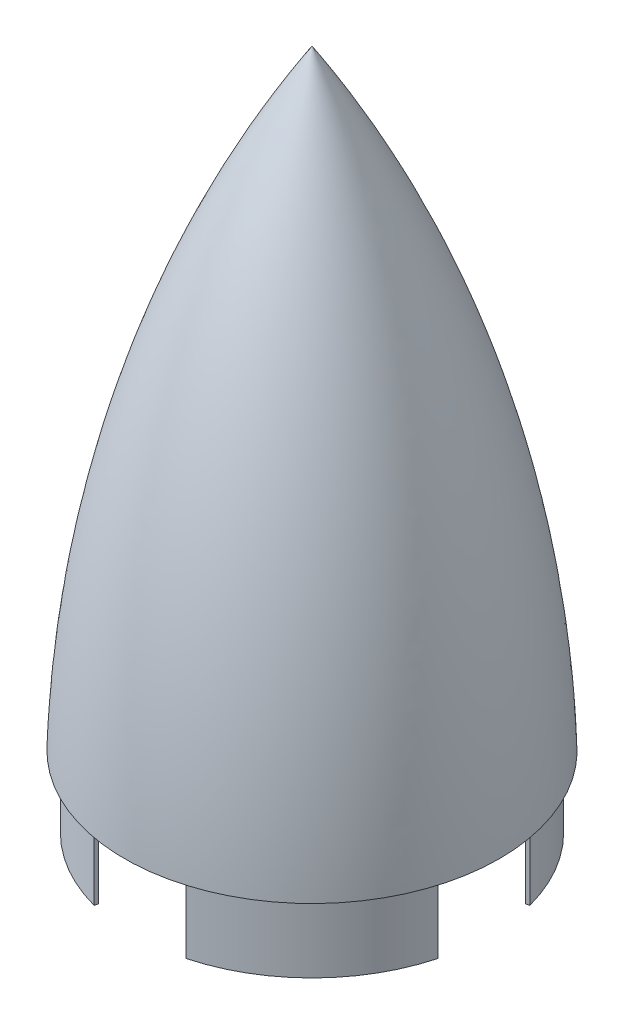
ISO-10303-21;
HEADER;
FILE_DESCRIPTION(('STEP AP214'),'2;1');
FILE_NAME('part.step','',(''),(''),'','','');
FILE_SCHEMA(('AUTOMOTIVE_DESIGN { 1 0 10303 214 1 1 1 1 }'));
ENDSEC;
DATA;
#1=APPLICATION_CONTEXT('core data for automotive mechanical design processes');
#2=APPLICATION_PROTOCOL_DEFINITION('international standard','automotive_design',2000,#1);
#3=PRODUCT_CONTEXT('',#1,'mechanical');
#4=PRODUCT('Part','Part','',(#3));
#5=PRODUCT_RELATED_PRODUCT_CATEGORY('part','',(#4));
#6=PRODUCT_DEFINITION_FORMATION('','',#4);
#7=PRODUCT_DEFINITION_CONTEXT('part definition',#1,'design');
#8=PRODUCT_DEFINITION('design','',#6,#7);
#9=PRODUCT_DEFINITION_SHAPE('','',#8);
#10=(LENGTH_UNIT() NAMED_UNIT(*) SI_UNIT(.MILLI.,.METRE.));
#11=(NAMED_UNIT(*) PLANE_ANGLE_UNIT() SI_UNIT($,.RADIAN.));
#12=(NAMED_UNIT(*) SI_UNIT($,.STERADIAN.) SOLID_ANGLE_UNIT());
#13=UNCERTAINTY_MEASURE_WITH_UNIT(LENGTH_MEASURE(1.E-05),#10,'distance_accuracy_value','');
#14=(GEOMETRIC_REPRESENTATION_CONTEXT(3) GLOBAL_UNCERTAINTY_ASSIGNED_CONTEXT((#13)) GLOBAL_UNIT_ASSIGNED_CONTEXT((#10,
#11,#12)) REPRESENTATION_CONTEXT('',''));
#15=CARTESIAN_POINT('',(0.,0.,0.));
#16=DIRECTION('',(0.,0.,1.));
#17=DIRECTION('',(1.,0.,0.));
#18=AXIS2_PLACEMENT_3D('',#15,#16,#17);
#19=CARTESIAN_POINT('',(-1.04516256426433E-13,-35.56,0.));
#20=DIRECTION('',(0.,-1.,0.));
#21=DIRECTION('',(1.,0.,0.));
#22=AXIS2_PLACEMENT_3D('',#19,#20,#21);
#23=PLANE('',#22);
#24=CARTESIAN_POINT('',(-1.04516256426433E-13,-35.56,0.));
#25=DIRECTION('',(0.,-1.,0.));
#26=DIRECTION('',(1.,0.,0.));
#27=AXIS2_PLACEMENT_3D('',#24,#25,#26);
#28=CIRCLE('',#27,88.9);
#29=CARTESIAN_POINT('',(23.0090131095874,-35.5600000000001,-85.8708059571041));
#30=VERTEX_POINT('',#29);
#31=CARTESIAN_POINT('',(85.8708059570982,-35.5600000000003,-23.0090131096142));
#32=VERTEX_POINT('',#31);
#33=EDGE_CURVE('E98',#30,#32,#28,.T.);
#34=ORIENTED_EDGE('',*,*,#33,.T.);
#35=DIRECTION('',(0.965925826289068,0.,-0.258819045102521));
#36=VECTOR('',#35,1.);
#37=CARTESIAN_POINT('',(85.8708059570981,-35.5600000000003,-23.0090131096142));
#38=LINE('',#37,#36);
#39=CARTESIAN_POINT('',(84.0307172580174,-35.5600000000002,-22.5159628286938));
#40=VERTEX_POINT('',#39);
#41=EDGE_CURVE('E57',#40,#32,#38,.T.);
#42=ORIENTED_EDGE('',*,*,#41,.F.);
#43=CARTESIAN_POINT('',(-1.04516256426433E-13,-35.56,0.));
#44=DIRECTION('',(0.,-1.,0.));
#45=DIRECTION('',(1.,0.,0.));
#46=AXIS2_PLACEMENT_3D('',#43,#44,#45);
#47=CIRCLE('',#46,86.995);
#48=CARTESIAN_POINT('',(22.5159628286674,-35.5600000000001,-84.0307172580245));
#49=VERTEX_POINT('',#48);
#50=EDGE_CURVE('E52',#49,#40,#47,.T.);
#51=ORIENTED_EDGE('',*,*,#50,.F.);
#52=DIRECTION('',(-0.258819045102512,0.,0.965925826289071));
#53=VECTOR('',#52,1.);
#54=CARTESIAN_POINT('',(23.0090131095874,-35.5600000000001,-85.8708059571041));
#55=LINE('',#54,#53);
#56=EDGE_CURVE('E102',#30,#49,#55,.T.);
#57=ORIENTED_EDGE('',*,*,#56,.F.);
#58=EDGE_LOOP('',(#34,#42,#51,#57));
#59=FACE_BOUND('',#58,.T.);
#60=ADVANCED_FACE('F49',(#59),#23,.T.);
#61=CARTESIAN_POINT('',(0.,0.,0.));
#62=DIRECTION('',(0.,-1.,0.));
#63=DIRECTION('',(1.,0.,0.));
#64=AXIS2_PLACEMENT_3D('',#61,#62,#63);
#65=PLANE('',#64);
#66=DIRECTION('',(0.965925826289068,0.,-0.258819045102521));
#67=VECTOR('',#66,1.);
#68=CARTESIAN_POINT('',(85.8708059570982,-2.52387378373357E-13,-23.0090131096142));
#69=LINE('',#68,#67);
#70=CARTESIAN_POINT('',(84.0307172580175,-2.46979077408214E-13,-22.5159628286938));
#71=VERTEX_POINT('',#70);
#72=CARTESIAN_POINT('',(85.8708059570982,-2.52387378373357E-13,-23.0090131096142));
#73=VERTEX_POINT('',#72);
#74=EDGE_CURVE('E70',#71,#73,#69,.T.);
#75=ORIENTED_EDGE('',*,*,#74,.T.);
#76=CARTESIAN_POINT('',(0.,0.,0.));
#77=DIRECTION('',(0.,-1.,0.));
#78=DIRECTION('',(1.,0.,0.));
#79=AXIS2_PLACEMENT_3D('',#76,#77,#78);
#80=CIRCLE('',#79,88.9);
#81=CARTESIAN_POINT('',(23.0090131095875,0.,-85.8708059571041));
#82=VERTEX_POINT('',#81);
#83=EDGE_CURVE('E100',#82,#73,#80,.T.);
#84=ORIENTED_EDGE('',*,*,#83,.F.);
#85=DIRECTION('',(-0.258819045102512,0.,0.965925826289071));
#86=VECTOR('',#85,1.);
#87=CARTESIAN_POINT('',(23.0090131095875,0.,-85.8708059571041));
#88=LINE('',#87,#86);
#89=CARTESIAN_POINT('',(22.5159628286675,0.,-84.0307172580245));
#90=VERTEX_POINT('',#89);
#91=EDGE_CURVE('E104',#82,#90,#88,.T.);
#92=ORIENTED_EDGE('',*,*,#91,.T.);
#93=CARTESIAN_POINT('',(0.,0.,0.));
#94=DIRECTION('',(0.,-1.,0.));
#95=DIRECTION('',(1.,0.,0.));
#96=AXIS2_PLACEMENT_3D('',#93,#94,#95);
#97=CIRCLE('',#96,86.995);
#98=EDGE_CURVE('E107',#90,#71,#97,.T.);
#99=ORIENTED_EDGE('',*,*,#98,.T.);
#100=EDGE_LOOP('',(#75,#84,#92,#99));
#101=FACE_BOUND('',#100,.T.);
#102=ADVANCED_FACE('F121',(#101),#65,.F.);
#103=CARTESIAN_POINT('',(-1.04516256426433E-13,-35.56,0.));
#104=DIRECTION('',(0.,1.,0.));
#105=DIRECTION('',(-1.,0.,0.));
#106=AXIS2_PLACEMENT_3D('',#103,#104,#105);
#107=CYLINDRICAL_SURFACE('',#106,88.9);
#108=DIRECTION('',(0.,1.,0.));
#109=VECTOR('',#108,1.);
#110=CARTESIAN_POINT('',(85.8708059570979,-81.8349246518821,-23.0090131096142));
#111=LINE('',#110,#109);
#112=EDGE_CURVE('E12',#32,#73,#111,.T.);
#113=ORIENTED_EDGE('',*,*,#112,.F.);
#114=ORIENTED_EDGE('',*,*,#33,.F.);
#115=DIRECTION('',(0.,1.,0.));
#116=VECTOR('',#115,1.);
#117=CARTESIAN_POINT('',(23.0090131095873,-81.8349246518819,-85.8708059571041));
#118=LINE('',#117,#116);
#119=EDGE_CURVE('E109',#30,#82,#118,.T.);
#120=ORIENTED_EDGE('',*,*,#119,.T.);
#121=ORIENTED_EDGE('',*,*,#83,.T.);
#122=EDGE_LOOP('',(#113,#114,#120,#121));
#123=FACE_BOUND('',#122,.T.);
#124=ADVANCED_FACE('F96',(#123),#107,.T.);
#125=CARTESIAN_POINT('',(-1.04516256426433E-13,-35.56,0.));
#126=DIRECTION('',(0.,1.,0.));
#127=DIRECTION('',(-1.,0.,0.));
#128=AXIS2_PLACEMENT_3D('',#125,#126,#127);
#129=CYLINDRICAL_SURFACE('',#128,86.995);
#130=ORIENTED_EDGE('',*,*,#50,.T.);
#131=DIRECTION('',(0.,1.,0.));
#132=VECTOR('',#131,1.);
#133=CARTESIAN_POINT('',(84.0307172580172,-81.8349246518821,-22.5159628286938));
#134=LINE('',#133,#132);
#135=EDGE_CURVE('E65',#40,#71,#134,.T.);
#136=ORIENTED_EDGE('',*,*,#135,.T.);
#137=ORIENTED_EDGE('',*,*,#98,.F.);
#138=DIRECTION('',(0.,1.,0.));
#139=VECTOR('',#138,1.);
#140=CARTESIAN_POINT('',(22.5159628286673,-81.8349246518819,-84.0307172580245));
#141=LINE('',#140,#139);
#142=EDGE_CURVE('E91',#49,#90,#141,.T.);
#143=ORIENTED_EDGE('',*,*,#142,.F.);
#144=EDGE_LOOP('',(#130,#136,#137,#143));
#145=FACE_BOUND('',#144,.T.);
#146=ADVANCED_FACE('F118',(#145),#129,.F.);
#147=CARTESIAN_POINT('',(23.0090131095873,-81.8349246518819,-85.8708059571041));
#148=DIRECTION('',(-0.965925826289071,0.,-0.258819045102512));
#149=DIRECTION('',(-0.258819045102512,0.,0.965925826289071));
#150=AXIS2_PLACEMENT_3D('',#147,#148,#149);
#151=PLANE('',#150);
#152=ORIENTED_EDGE('',*,*,#56,.T.);
#153=ORIENTED_EDGE('',*,*,#142,.T.);
#154=ORIENTED_EDGE('',*,*,#91,.F.);
#155=ORIENTED_EDGE('',*,*,#119,.F.);
#156=EDGE_LOOP('',(#152,#153,#154,#155));
#157=FACE_BOUND('',#156,.T.);
#158=ADVANCED_FACE('F123',(#157),#151,.T.);
#159=CARTESIAN_POINT('',(85.8708059570979,-81.8349246518821,-23.0090131096142));
#160=DIRECTION('',(0.258819045102521,0.,0.965925826289068));
#161=DIRECTION('',(0.965925826289068,0.,-0.258819045102521));
#162=AXIS2_PLACEMENT_3D('',#159,#160,#161);
#163=PLANE('',#162);
#164=ORIENTED_EDGE('',*,*,#41,.T.);
#165=ORIENTED_EDGE('',*,*,#112,.T.);
#166=ORIENTED_EDGE('',*,*,#74,.F.);
#167=ORIENTED_EDGE('',*,*,#135,.F.);
#168=EDGE_LOOP('',(#164,#165,#166,#167));
#169=FACE_BOUND('',#168,.T.);
#170=ADVANCED_FACE('F86',(#169),#163,.T.);
#171=CLOSED_SHELL('',(#60,#102,#124,#146,#158,#170));
#172=MANIFOLD_SOLID_BREP('B2',#171);
#173=CARTESIAN_POINT('',(-1.04516256426433E-13,-35.56,0.));
#174=DIRECTION('',(0.,1.,0.));
#175=DIRECTION('',(-1.,0.,0.));
#176=AXIS2_PLACEMENT_3D('',#173,#174,#175);
#177=CYLINDRICAL_SURFACE('',#176,86.995);
#178=CARTESIAN_POINT('',(-1.04516256426433E-13,-35.56,0.));
#179=DIRECTION('',(0.,-1.,0.));
#180=DIRECTION('',(1.,0.,0.));
#181=AXIS2_PLACEMENT_3D('',#178,#179,#180);
#182=CIRCLE('',#181,86.995);
#183=CARTESIAN_POINT('',(-22.5159628287198,-35.5599999999999,84.0307172580106));
#184=VERTEX_POINT('',#183);
#185=CARTESIAN_POINT('',(-84.0307172580194,-35.5599999999997,22.5159628286869));
#186=VERTEX_POINT('',#185);
#187=EDGE_CURVE('E243',#184,#186,#182,.T.);
#188=ORIENTED_EDGE('',*,*,#187,.T.);
#189=DIRECTION('',(0.,1.,0.));
#190=VECTOR('',#189,1.);
#191=CARTESIAN_POINT('',(-84.0307172580195,-81.8349246518816,22.5159628286869));
#192=LINE('',#191,#190);
#193=CARTESIAN_POINT('',(-84.0307172580193,2.46979077408219E-13,22.5159628286869));
#194=VERTEX_POINT('',#193);
#195=EDGE_CURVE('E199',#186,#194,#192,.T.);
#196=ORIENTED_EDGE('',*,*,#195,.T.);
#197=CARTESIAN_POINT('',(0.,0.,0.));
#198=DIRECTION('',(0.,-1.,0.));
#199=DIRECTION('',(1.,0.,0.));
#200=AXIS2_PLACEMENT_3D('',#197,#198,#199);
#201=CIRCLE('',#200,86.995);
#202=CARTESIAN_POINT('',(-22.5159628287196,0.,84.0307172580106));
#203=VERTEX_POINT('',#202);
#204=EDGE_CURVE('E236',#203,#194,#201,.T.);
#205=ORIENTED_EDGE('',*,*,#204,.F.);
#206=DIRECTION('',(0.,1.,0.));
#207=VECTOR('',#206,1.);
#208=CARTESIAN_POINT('',(-22.5159628287199,-81.8349246518817,84.0307172580106));
#209=LINE('',#208,#207);
#210=EDGE_CURVE('E225',#184,#203,#209,.T.);
#211=ORIENTED_EDGE('',*,*,#210,.F.);
#212=EDGE_LOOP('',(#188,#196,#205,#211));
#213=FACE_BOUND('',#212,.T.);
#214=ADVANCED_FACE('F182',(#213),#177,.F.);
#215=CARTESIAN_POINT('',(-1.04516256426433E-13,-35.56,0.));
#216=DIRECTION('',(0.,1.,0.));
#217=DIRECTION('',(-1.,0.,0.));
#218=AXIS2_PLACEMENT_3D('',#215,#216,#217);
#219=CYLINDRICAL_SURFACE('',#218,88.9);
#220=DIRECTION('',(0.,1.,0.));
#221=VECTOR('',#220,1.);
#222=CARTESIAN_POINT('',(-85.8708059571002,-81.8349246518816,23.0090131096072));
#223=LINE('',#222,#221);
#224=CARTESIAN_POINT('',(-85.8708059571,-35.5600000000003,23.0090131096072));
#225=VERTEX_POINT('',#224);
#226=CARTESIAN_POINT('',(-85.8708059570999,2.52387378373362E-13,23.0090131096072));
#227=VERTEX_POINT('',#226);
#228=EDGE_CURVE('E47',#225,#227,#223,.T.);
#229=ORIENTED_EDGE('',*,*,#228,.F.);
#230=CARTESIAN_POINT('',(-1.04516256426433E-13,-35.56,0.));
#231=DIRECTION('',(0.,-1.,0.));
#232=DIRECTION('',(1.,0.,0.));
#233=AXIS2_PLACEMENT_3D('',#230,#231,#232);
#234=CIRCLE('',#233,88.9);
#235=CARTESIAN_POINT('',(-23.0090131096399,-35.5599999999999,85.8708059570906));
#236=VERTEX_POINT('',#235);
#237=EDGE_CURVE('E232',#236,#225,#234,.T.);
#238=ORIENTED_EDGE('',*,*,#237,.F.);
#239=DIRECTION('',(0.,1.,0.));
#240=VECTOR('',#239,1.);
#241=CARTESIAN_POINT('',(-23.00901310964,-81.8349246518817,85.8708059570906));
#242=LINE('',#241,#240);
#243=CARTESIAN_POINT('',(-23.0090131096398,0.,85.8708059570906));
#244=VERTEX_POINT('',#243);
#245=EDGE_CURVE('E246',#236,#244,#242,.T.);
#246=ORIENTED_EDGE('',*,*,#245,.T.);
#247=CARTESIAN_POINT('',(0.,0.,0.));
#248=DIRECTION('',(0.,-1.,0.));
#249=DIRECTION('',(1.,0.,0.));
#250=AXIS2_PLACEMENT_3D('',#247,#248,#249);
#251=CIRCLE('',#250,88.9);
#252=EDGE_CURVE('E186',#244,#227,#251,.T.);
#253=ORIENTED_EDGE('',*,*,#252,.T.);
#254=EDGE_LOOP('',(#229,#238,#246,#253));
#255=FACE_BOUND('',#254,.T.);
#256=ADVANCED_FACE('F230',(#255),#219,.T.);
#257=CARTESIAN_POINT('',(0.,0.,0.));
#258=DIRECTION('',(0.,-1.,0.));
#259=DIRECTION('',(1.,0.,0.));
#260=AXIS2_PLACEMENT_3D('',#257,#258,#259);
#261=PLANE('',#260);
#262=DIRECTION('',(-0.965925826289068,0.,0.258819045102522));
#263=VECTOR('',#262,1.);
#264=CARTESIAN_POINT('',(-84.0307172580193,2.46979077408219E-13,22.5159628286869));
#265=LINE('',#264,#263);
#266=EDGE_CURVE('E204',#194,#227,#265,.T.);
#267=ORIENTED_EDGE('',*,*,#266,.T.);
#268=ORIENTED_EDGE('',*,*,#252,.F.);
#269=DIRECTION('',(0.258819045102524,0.,-0.965925826289068));
#270=VECTOR('',#269,1.);
#271=CARTESIAN_POINT('',(-22.5159628287196,0.,84.0307172580106));
#272=LINE('',#271,#270);
#273=EDGE_CURVE('E240',#244,#203,#272,.T.);
#274=ORIENTED_EDGE('',*,*,#273,.T.);
#275=ORIENTED_EDGE('',*,*,#204,.T.);
#276=EDGE_LOOP('',(#267,#268,#274,#275));
#277=FACE_BOUND('',#276,.T.);
#278=ADVANCED_FACE('F256',(#277),#261,.F.);
#279=CARTESIAN_POINT('',(-1.04516256426433E-13,-35.56,0.));
#280=DIRECTION('',(0.,-1.,0.));
#281=DIRECTION('',(1.,0.,0.));
#282=AXIS2_PLACEMENT_3D('',#279,#280,#281);
#283=PLANE('',#282);
#284=ORIENTED_EDGE('',*,*,#237,.T.);
#285=DIRECTION('',(-0.965925826289068,0.,0.258819045102522));
#286=VECTOR('',#285,1.);
#287=CARTESIAN_POINT('',(-84.0307172580194,-35.5599999999998,22.5159628286869));
#288=LINE('',#287,#286);
#289=EDGE_CURVE('E191',#186,#225,#288,.T.);
#290=ORIENTED_EDGE('',*,*,#289,.F.);
#291=ORIENTED_EDGE('',*,*,#187,.F.);
#292=DIRECTION('',(0.258819045102524,0.,-0.965925826289068));
#293=VECTOR('',#292,1.);
#294=CARTESIAN_POINT('',(-22.5159628287198,-35.5599999999999,84.0307172580106));
#295=LINE('',#294,#293);
#296=EDGE_CURVE('E235',#236,#184,#295,.T.);
#297=ORIENTED_EDGE('',*,*,#296,.F.);
#298=EDGE_LOOP('',(#284,#290,#291,#297));
#299=FACE_BOUND('',#298,.T.);
#300=ADVANCED_FACE('F184',(#299),#283,.T.);
#301=CARTESIAN_POINT('',(-22.5159628287199,-81.8349246518817,84.0307172580106));
#302=DIRECTION('',(0.965925826289068,0.,0.258819045102524));
#303=DIRECTION('',(0.258819045102524,0.,-0.965925826289068));
#304=AXIS2_PLACEMENT_3D('',#301,#302,#303);
#305=PLANE('',#304);
#306=ORIENTED_EDGE('',*,*,#296,.T.);
#307=ORIENTED_EDGE('',*,*,#210,.T.);
#308=ORIENTED_EDGE('',*,*,#273,.F.);
#309=ORIENTED_EDGE('',*,*,#245,.F.);
#310=EDGE_LOOP('',(#306,#307,#308,#309));
#311=FACE_BOUND('',#310,.T.);
#312=ADVANCED_FACE('F254',(#311),#305,.T.);
#313=CARTESIAN_POINT('',(-84.0307172580195,-81.8349246518816,22.5159628286869));
#314=DIRECTION('',(-0.258819045102522,0.,-0.965925826289068));
#315=DIRECTION('',(-0.965925826289068,0.,0.258819045102522));
#316=AXIS2_PLACEMENT_3D('',#313,#314,#315);
#317=PLANE('',#316);
#318=ORIENTED_EDGE('',*,*,#289,.T.);
#319=ORIENTED_EDGE('',*,*,#228,.T.);
#320=ORIENTED_EDGE('',*,*,#266,.F.);
#321=ORIENTED_EDGE('',*,*,#195,.F.);
#322=EDGE_LOOP('',(#318,#319,#320,#321));
#323=FACE_BOUND('',#322,.T.);
#324=ADVANCED_FACE('F220',(#323),#317,.T.);
#325=CLOSED_SHELL('',(#214,#256,#278,#300,#312,#324));
#326=MANIFOLD_SOLID_BREP('B6',#325);
#327=CARTESIAN_POINT('',(-1.04516256426433E-13,-35.56,0.));
#328=DIRECTION('',(0.,1.,0.));
#329=DIRECTION('',(-1.,0.,0.));
#330=AXIS2_PLACEMENT_3D('',#327,#328,#329);
#331=CYLINDRICAL_SURFACE('',#330,88.9);
#332=DIRECTION('',(0.,1.,0.));
#333=VECTOR('',#332,1.);
#334=CARTESIAN_POINT('',(85.8708059570962,-81.8349246518821,23.0090131096136));
#335=LINE('',#334,#333);
#336=CARTESIAN_POINT('',(85.8708059570964,-35.5600000000003,23.0090131096136));
#337=VERTEX_POINT('',#336);
#338=CARTESIAN_POINT('',(85.8708059570965,-2.52387378373352E-13,23.0090131096136));
#339=VERTEX_POINT('',#338);
#340=EDGE_CURVE('E332',#337,#339,#335,.T.);
#341=ORIENTED_EDGE('',*,*,#340,.T.);
#342=CARTESIAN_POINT('',(0.,0.,0.));
#343=DIRECTION('',(0.,-1.,0.));
#344=DIRECTION('',(1.,0.,0.));
#345=AXIS2_PLACEMENT_3D('',#342,#343,#344);
#346=CIRCLE('',#345,88.9);
#347=CARTESIAN_POINT('',(23.0090131096138,0.,85.870805957097));
#348=VERTEX_POINT('',#347);
#349=EDGE_CURVE('E383',#339,#348,#346,.T.);
#350=ORIENTED_EDGE('',*,*,#349,.T.);
#351=DIRECTION('',(0.,1.,0.));
#352=VECTOR('',#351,1.);
#353=CARTESIAN_POINT('',(23.0090131096136,-81.8349246518819,85.870805957097));
#354=LINE('',#353,#352);
#355=CARTESIAN_POINT('',(23.0090131096137,-35.5600000000003,85.870805957097));
#356=VERTEX_POINT('',#355);
#357=EDGE_CURVE('E360',#356,#348,#354,.T.);
#358=ORIENTED_EDGE('',*,*,#357,.F.);
#359=CARTESIAN_POINT('',(-1.04516256426433E-13,-35.56,0.));
#360=DIRECTION('',(0.,-1.,0.));
#361=DIRECTION('',(1.,0.,0.));
#362=AXIS2_PLACEMENT_3D('',#359,#360,#361);
#363=CIRCLE('',#362,88.9);
#364=EDGE_CURVE('E365',#337,#356,#363,.T.);
#365=ORIENTED_EDGE('',*,*,#364,.F.);
#366=EDGE_LOOP('',(#341,#350,#358,#365));
#367=FACE_BOUND('',#366,.T.);
#368=ADVANCED_FACE('F315',(#367),#331,.T.);
#369=CARTESIAN_POINT('',(-1.04516256426433E-13,-35.56,0.));
#370=DIRECTION('',(0.,1.,0.));
#371=DIRECTION('',(-1.,0.,0.));
#372=AXIS2_PLACEMENT_3D('',#369,#370,#371);
#373=CYLINDRICAL_SURFACE('',#372,86.995);
#374=CARTESIAN_POINT('',(0.,0.,0.));
#375=DIRECTION('',(0.,-1.,0.));
#376=DIRECTION('',(1.,0.,0.));
#377=AXIS2_PLACEMENT_3D('',#374,#375,#376);
#378=CIRCLE('',#377,86.995);
#379=CARTESIAN_POINT('',(84.0307172580175,-2.46979077408214E-13,22.5159628286938));
#380=VERTEX_POINT('',#379);
#381=CARTESIAN_POINT('',(22.5159628286938,0.,84.0307172580175));
#382=VERTEX_POINT('',#381);
#383=EDGE_CURVE('E319',#380,#382,#378,.T.);
#384=ORIENTED_EDGE('',*,*,#383,.F.);
#385=DIRECTION('',(0.,1.,0.));
#386=VECTOR('',#385,1.);
#387=CARTESIAN_POINT('',(84.0307172580173,-81.8349246518821,22.5159628286938));
#388=LINE('',#387,#386);
#389=CARTESIAN_POINT('',(84.0307172580174,-35.5600000000003,22.5159628286938));
#390=VERTEX_POINT('',#389);
#391=EDGE_CURVE('E180',#390,#380,#388,.T.);
#392=ORIENTED_EDGE('',*,*,#391,.F.);
#393=CARTESIAN_POINT('',(-1.04516256426433E-13,-35.56,0.));
#394=DIRECTION('',(0.,-1.,0.));
#395=DIRECTION('',(1.,0.,0.));
#396=AXIS2_PLACEMENT_3D('',#393,#394,#395);
#397=CIRCLE('',#396,86.995);
#398=CARTESIAN_POINT('',(22.5159628286937,-35.5600000000001,84.0307172580175));
#399=VERTEX_POINT('',#398);
#400=EDGE_CURVE('E373',#390,#399,#397,.T.);
#401=ORIENTED_EDGE('',*,*,#400,.T.);
#402=DIRECTION('',(0.,1.,0.));
#403=VECTOR('',#402,1.);
#404=CARTESIAN_POINT('',(22.5159628286936,-81.8349246518819,84.0307172580175));
#405=LINE('',#404,#403);
#406=EDGE_CURVE('E357',#399,#382,#405,.T.);
#407=ORIENTED_EDGE('',*,*,#406,.T.);
#408=EDGE_LOOP('',(#384,#392,#401,#407));
#409=FACE_BOUND('',#408,.T.);
#410=ADVANCED_FACE('F370',(#409),#373,.F.);
#411=CARTESIAN_POINT('',(0.,0.,0.));
#412=DIRECTION('',(0.,-1.,0.));
#413=DIRECTION('',(1.,0.,0.));
#414=AXIS2_PLACEMENT_3D('',#411,#412,#413);
#415=PLANE('',#414);
#416=DIRECTION('',(-0.965925826289068,0.,-0.258819045102521));
#417=VECTOR('',#416,1.);
#418=CARTESIAN_POINT('',(84.0307172580175,-2.46979077408214E-13,22.5159628286938));
#419=LINE('',#418,#417);
#420=EDGE_CURVE('E337',#339,#380,#419,.T.);
#421=ORIENTED_EDGE('',*,*,#420,.T.);
#422=ORIENTED_EDGE('',*,*,#383,.T.);
#423=DIRECTION('',(0.258819045102523,0.,0.965925826289068));
#424=VECTOR('',#423,1.);
#425=CARTESIAN_POINT('',(23.0090131096138,0.,85.870805957097));
#426=LINE('',#425,#424);
#427=EDGE_CURVE('E354',#382,#348,#426,.T.);
#428=ORIENTED_EDGE('',*,*,#427,.T.);
#429=ORIENTED_EDGE('',*,*,#349,.F.);
#430=EDGE_LOOP('',(#421,#422,#428,#429));
#431=FACE_BOUND('',#430,.T.);
#432=ADVANCED_FACE('F375',(#431),#415,.F.);
#433=CARTESIAN_POINT('',(-1.04516256426433E-13,-35.56,0.));
#434=DIRECTION('',(0.,-1.,0.));
#435=DIRECTION('',(1.,0.,0.));
#436=AXIS2_PLACEMENT_3D('',#433,#434,#435);
#437=PLANE('',#436);
#438=ORIENTED_EDGE('',*,*,#400,.F.);
#439=DIRECTION('',(-0.965925826289068,0.,-0.258819045102521));
#440=VECTOR('',#439,1.);
#441=CARTESIAN_POINT('',(84.0307172580174,-35.5600000000003,22.5159628286938));
#442=LINE('',#441,#440);
#443=EDGE_CURVE('E324',#337,#390,#442,.T.);
#444=ORIENTED_EDGE('',*,*,#443,.F.);
#445=ORIENTED_EDGE('',*,*,#364,.T.);
#446=DIRECTION('',(0.258819045102523,0.,0.965925826289068));
#447=VECTOR('',#446,1.);
#448=CARTESIAN_POINT('',(23.0090131096137,-35.5600000000001,85.870805957097));
#449=LINE('',#448,#447);
#450=EDGE_CURVE('E382',#399,#356,#449,.T.);
#451=ORIENTED_EDGE('',*,*,#450,.F.);
#452=EDGE_LOOP('',(#438,#444,#445,#451));
#453=FACE_BOUND('',#452,.T.);
#454=ADVANCED_FACE('F317',(#453),#437,.T.);
#455=CARTESIAN_POINT('',(23.0090131096136,-81.8349246518819,85.870805957097));
#456=DIRECTION('',(-0.965925826289068,0.,0.258819045102523));
#457=DIRECTION('',(0.258819045102523,0.,0.965925826289068));
#458=AXIS2_PLACEMENT_3D('',#455,#456,#457);
#459=PLANE('',#458);
#460=ORIENTED_EDGE('',*,*,#450,.T.);
#461=ORIENTED_EDGE('',*,*,#357,.T.);
#462=ORIENTED_EDGE('',*,*,#427,.F.);
#463=ORIENTED_EDGE('',*,*,#406,.F.);
#464=EDGE_LOOP('',(#460,#461,#462,#463));
#465=FACE_BOUND('',#464,.T.);
#466=ADVANCED_FACE('F356',(#465),#459,.T.);
#467=CARTESIAN_POINT('',(84.0307172580173,-81.8349246518821,22.5159628286938));
#468=DIRECTION('',(0.258819045102521,0.,-0.965925826289068));
#469=DIRECTION('',(-0.965925826289068,0.,-0.258819045102521));
#470=AXIS2_PLACEMENT_3D('',#467,#468,#469);
#471=PLANE('',#470);
#472=ORIENTED_EDGE('',*,*,#443,.T.);
#473=ORIENTED_EDGE('',*,*,#391,.T.);
#474=ORIENTED_EDGE('',*,*,#420,.F.);
#475=ORIENTED_EDGE('',*,*,#340,.F.);
#476=EDGE_LOOP('',(#472,#473,#474,#475));
#477=FACE_BOUND('',#476,.T.);
#478=ADVANCED_FACE('F388',(#477),#471,.T.);
#479=CLOSED_SHELL('',(#368,#410,#432,#454,#466,#478));
#480=MANIFOLD_SOLID_BREP('B41',#479);
#481=CARTESIAN_POINT('',(-1.04516256426433E-13,-35.56,0.));
#482=DIRECTION('',(0.,1.,0.));
#483=DIRECTION('',(-1.,0.,0.));
#484=AXIS2_PLACEMENT_3D('',#481,#482,#483);
#485=CYLINDRICAL_SURFACE('',#484,86.995);
#486=CARTESIAN_POINT('',(-1.04516256426433E-13,-35.56,0.));
#487=DIRECTION('',(0.,-1.,0.));
#488=DIRECTION('',(1.,0.,0.));
#489=AXIS2_PLACEMENT_3D('',#486,#487,#488);
#490=CIRCLE('',#489,86.995);
#491=CARTESIAN_POINT('',(-84.0307172580176,-35.5599999999998,-22.5159628286939));
#492=VERTEX_POINT('',#491);
#493=CARTESIAN_POINT('',(-22.5159628287202,-35.5599999999999,-84.0307172580104));
#494=VERTEX_POINT('',#493);
#495=EDGE_CURVE('E499',#492,#494,#490,.T.);
#496=ORIENTED_EDGE('',*,*,#495,.T.);
#497=DIRECTION('',(0.,1.,0.));
#498=VECTOR('',#497,1.);
#499=CARTESIAN_POINT('',(-22.5159628287204,-81.8349246518817,-84.0307172580104));
#500=LINE('',#499,#498);
#501=CARTESIAN_POINT('',(-22.5159628287202,0.,-84.0307172580104));
#502=VERTEX_POINT('',#501);
#503=EDGE_CURVE('E485',#494,#502,#500,.T.);
#504=ORIENTED_EDGE('',*,*,#503,.T.);
#505=CARTESIAN_POINT('',(0.,0.,0.));
#506=DIRECTION('',(0.,-1.,0.));
#507=DIRECTION('',(1.,0.,0.));
#508=AXIS2_PLACEMENT_3D('',#505,#506,#507);
#509=CIRCLE('',#508,86.995);
#510=CARTESIAN_POINT('',(-84.0307172580175,2.46979077408214E-13,-22.5159628286939));
#511=VERTEX_POINT('',#510);
#512=EDGE_CURVE('E501',#511,#502,#509,.T.);
#513=ORIENTED_EDGE('',*,*,#512,.F.);
#514=DIRECTION('',(0.,1.,0.));
#515=VECTOR('',#514,1.);
#516=CARTESIAN_POINT('',(-84.0307172580177,-81.8349246518816,-22.5159628286939));
#517=LINE('',#516,#515);
#518=EDGE_CURVE('E503',#492,#511,#517,.T.);
#519=ORIENTED_EDGE('',*,*,#518,.F.);
#520=EDGE_LOOP('',(#496,#504,#513,#519));
#521=FACE_BOUND('',#520,.T.);
#522=ADVANCED_FACE('F447',(#521),#485,.F.);
#523=CARTESIAN_POINT('',(-1.04516256426433E-13,-35.56,0.));
#524=DIRECTION('',(0.,1.,0.));
#525=DIRECTION('',(-1.,0.,0.));
#526=AXIS2_PLACEMENT_3D('',#523,#524,#525);
#527=CYLINDRICAL_SURFACE('',#526,88.9);
#528=DIRECTION('',(0.,1.,0.));
#529=VECTOR('',#528,1.);
#530=CARTESIAN_POINT('',(-23.0090131096406,-81.8349246518817,-85.8708059570904));
#531=LINE('',#530,#529);
#532=CARTESIAN_POINT('',(-23.0090131096404,-35.5599999999999,-85.8708059570904));
#533=VERTEX_POINT('',#532);
#534=CARTESIAN_POINT('',(-23.0090131096403,0.,-85.8708059570904));
#535=VERTEX_POINT('',#534);
#536=EDGE_CURVE('E494',#533,#535,#531,.T.);
#537=ORIENTED_EDGE('',*,*,#536,.F.);
#538=CARTESIAN_POINT('',(-1.04516256426433E-13,-35.56,0.));
#539=DIRECTION('',(0.,-1.,0.));
#540=DIRECTION('',(1.,0.,0.));
#541=AXIS2_PLACEMENT_3D('',#538,#539,#540);
#542=CIRCLE('',#541,88.9);
#543=CARTESIAN_POINT('',(-85.8708059570982,-35.5599999999997,-23.0090131096142));
#544=VERTEX_POINT('',#543);
#545=EDGE_CURVE('E313',#544,#533,#542,.T.);
#546=ORIENTED_EDGE('',*,*,#545,.F.);
#547=DIRECTION('',(0.,1.,0.));
#548=VECTOR('',#547,1.);
#549=CARTESIAN_POINT('',(-85.8708059570983,-81.8349246518816,-23.0090131096142));
#550=LINE('',#549,#548);
#551=CARTESIAN_POINT('',(-85.8708059570981,2.52387378373357E-13,-23.0090131096142));
#552=VERTEX_POINT('',#551);
#553=EDGE_CURVE('E509',#544,#552,#550,.T.);
#554=ORIENTED_EDGE('',*,*,#553,.T.);
#555=CARTESIAN_POINT('',(0.,0.,0.));
#556=DIRECTION('',(0.,-1.,0.));
#557=DIRECTION('',(1.,0.,0.));
#558=AXIS2_PLACEMENT_3D('',#555,#556,#557);
#559=CIRCLE('',#558,88.9);
#560=EDGE_CURVE('E451',#552,#535,#559,.T.);
#561=ORIENTED_EDGE('',*,*,#560,.T.);
#562=EDGE_LOOP('',(#537,#546,#554,#561));
#563=FACE_BOUND('',#562,.T.);
#564=ADVANCED_FACE('F449',(#563),#527,.T.);
#565=CARTESIAN_POINT('',(0.,0.,0.));
#566=DIRECTION('',(0.,-1.,0.));
#567=DIRECTION('',(1.,0.,0.));
#568=AXIS2_PLACEMENT_3D('',#565,#566,#567);
#569=PLANE('',#568);
#570=DIRECTION('',(-0.258819045102527,0.,-0.965925826289067));
#571=VECTOR('',#570,1.);
#572=CARTESIAN_POINT('',(-22.5159628287202,0.,-84.0307172580104));
#573=LINE('',#572,#571);
#574=EDGE_CURVE('E462',#502,#535,#573,.T.);
#575=ORIENTED_EDGE('',*,*,#574,.T.);
#576=ORIENTED_EDGE('',*,*,#560,.F.);
#577=DIRECTION('',(0.965925826289067,0.,0.258819045102524));
#578=VECTOR('',#577,1.);
#579=CARTESIAN_POINT('',(-84.0307172580175,2.46979077408214E-13,-22.5159628286939));
#580=LINE('',#579,#578);
#581=EDGE_CURVE('E512',#552,#511,#580,.T.);
#582=ORIENTED_EDGE('',*,*,#581,.T.);
#583=ORIENTED_EDGE('',*,*,#512,.T.);
#584=EDGE_LOOP('',(#575,#576,#582,#583));
#585=FACE_BOUND('',#584,.T.);
#586=ADVANCED_FACE('F519',(#585),#569,.F.);
#587=CARTESIAN_POINT('',(-1.04516256426433E-13,-35.56,0.));
#588=DIRECTION('',(0.,-1.,0.));
#589=DIRECTION('',(1.,0.,0.));
#590=AXIS2_PLACEMENT_3D('',#587,#588,#589);
#591=PLANE('',#590);
#592=ORIENTED_EDGE('',*,*,#545,.T.);
#593=DIRECTION('',(-0.258819045102527,0.,-0.965925826289067));
#594=VECTOR('',#593,1.);
#595=CARTESIAN_POINT('',(-22.5159628287203,-35.5599999999999,-84.0307172580104));
#596=LINE('',#595,#594);
#597=EDGE_CURVE('E488',#494,#533,#596,.T.);
#598=ORIENTED_EDGE('',*,*,#597,.F.);
#599=ORIENTED_EDGE('',*,*,#495,.F.);
#600=DIRECTION('',(0.965925826289068,0.,0.258819045102524));
#601=VECTOR('',#600,1.);
#602=CARTESIAN_POINT('',(-84.0307172580176,-35.5599999999998,-22.5159628286939));
#603=LINE('',#602,#601);
#604=EDGE_CURVE('E470',#544,#492,#603,.T.);
#605=ORIENTED_EDGE('',*,*,#604,.F.);
#606=EDGE_LOOP('',(#592,#598,#599,#605));
#607=FACE_BOUND('',#606,.T.);
#608=ADVANCED_FACE('F498',(#607),#591,.T.);
#609=CARTESIAN_POINT('',(-84.0307172580177,-81.8349246518816,-22.5159628286939));
#610=DIRECTION('',(-0.258819045102524,0.,0.965925826289068));
#611=DIRECTION('',(0.965925826289068,0.,0.258819045102524));
#612=AXIS2_PLACEMENT_3D('',#609,#610,#611);
#613=PLANE('',#612);
#614=ORIENTED_EDGE('',*,*,#604,.T.);
#615=ORIENTED_EDGE('',*,*,#518,.T.);
#616=ORIENTED_EDGE('',*,*,#581,.F.);
#617=ORIENTED_EDGE('',*,*,#553,.F.);
#618=EDGE_LOOP('',(#614,#615,#616,#617));
#619=FACE_BOUND('',#618,.T.);
#620=ADVANCED_FACE('F521',(#619),#613,.T.);
#621=CARTESIAN_POINT('',(-22.5159628287204,-81.8349246518817,-84.0307172580104));
#622=DIRECTION('',(0.965925826289067,0.,-0.258819045102527));
#623=DIRECTION('',(-0.258819045102527,0.,-0.965925826289067));
#624=AXIS2_PLACEMENT_3D('',#621,#622,#623);
#625=PLANE('',#624);
#626=ORIENTED_EDGE('',*,*,#597,.T.);
#627=ORIENTED_EDGE('',*,*,#536,.T.);
#628=ORIENTED_EDGE('',*,*,#574,.F.);
#629=ORIENTED_EDGE('',*,*,#503,.F.);
#630=EDGE_LOOP('',(#626,#627,#628,#629));
#631=FACE_BOUND('',#630,.T.);
#632=ADVANCED_FACE('F487',(#631),#625,.T.);
#633=CLOSED_SHELL('',(#522,#564,#586,#608,#620,#632));
#634=MANIFOLD_SOLID_BREP('B174',#633);
#635=CARTESIAN_POINT('',(507.568702971262,-17.9374345129202,0.));
#636=DIRECTION('',(0.,0.,-1.));
#637=DIRECTION('',(-1.,0.,0.));
#638=AXIS2_PLACEMENT_3D('',#635,#636,#637);
#639=CIRCLE('',#638,601.486026331378);
#640=TRIMMED_CURVE('',#639,(PARAMETER_VALUE(-0.566363368481628)),
(PARAMETER_VALUE(0.566363368481628)),.T.,.PARAMETER.);
#641=CARTESIAN_POINT('',(-9.99200722162641E-13,-17.9374345129187,0.));
#642=DIRECTION('',(0.,1.,0.));
#643=AXIS1_PLACEMENT('',#641,#642);
#644=SURFACE_OF_REVOLUTION('',#640,#643);
#645=CARTESIAN_POINT('',(-8.95853626512287E-13,-2.77555756156289E-13,0.));
#646=DIRECTION('',(0.,1.,0.));
#647=DIRECTION('',(-1.,0.,0.));
#648=AXIS2_PLACEMENT_3D('',#645,#646,#647);
#649=CIRCLE('',#648,93.6497999999991);
#650=CARTESIAN_POINT('',(-93.6498,0.,0.));
#651=VERTEX_POINT('',#650);
#652=EDGE_CURVE('E445',#651,#651,#649,.T.);
#653=ORIENTED_EDGE('',*,*,#652,.T.);
#654=EDGE_LOOP('',(#653));
#655=FACE_BOUND('',#654,.T.);
#656=CARTESIAN_POINT('',(0.,304.8,0.));
#657=VERTEX_POINT('',#656);
#658=VERTEX_LOOP('',#657);
#659=FACE_BOUND('',#658,.T.);
#660=ADVANCED_FACE('F570',(#655,#659),#644,.T.);
#661=CARTESIAN_POINT('',(-93.6498,0.,0.));
#662=DIRECTION('',(0.,-1.,0.));
#663=DIRECTION('',(1.,0.,0.));
#664=AXIS2_PLACEMENT_3D('',#661,#662,#663);
#665=PLANE('',#664);
#666=CARTESIAN_POINT('',(-8.95853626512287E-13,-2.22044604925031E-13,0.));
#667=DIRECTION('',(0.,1.,0.));
#668=DIRECTION('',(-1.,0.,0.));
#669=AXIS2_PLACEMENT_3D('',#666,#667,#668);
#670=CIRCLE('',#669,88.8999999999991);
#671=CARTESIAN_POINT('',(-88.9,0.,0.));
#672=VERTEX_POINT('',#671);
#673=EDGE_CURVE('E578',#672,#672,#670,.T.);
#674=ORIENTED_EDGE('',*,*,#673,.T.);
#675=EDGE_LOOP('',(#674));
#676=FACE_BOUND('',#675,.T.);
#677=ORIENTED_EDGE('',*,*,#652,.F.);
#678=EDGE_LOOP('',(#677));
#679=FACE_BOUND('',#678,.T.);
#680=ADVANCED_FACE('F587',(#676,#679),#665,.T.);
#681=CARTESIAN_POINT('',(553.247806952805,-27.4232478249846,0.));
#682=DIRECTION('',(0.,0.,-1.));
#683=DIRECTION('',(-1.,0.,0.));
#684=AXIS2_PLACEMENT_3D('',#681,#682,#683);
#685=CIRCLE('',#684,642.733102069255);
#686=TRIMMED_CURVE('',#685,(PARAMETER_VALUE(-0.534008354046208)),
(PARAMETER_VALUE(0.534008354046208)),.T.,.PARAMETER.);
#687=CARTESIAN_POINT('',(-9.99200722162641E-13,-27.423247824983,0.));
#688=DIRECTION('',(0.,1.,0.));
#689=AXIS1_PLACEMENT('',#687,#688);
#690=SURFACE_OF_REVOLUTION('',#686,#689);
#691=CARTESIAN_POINT('',(0.,299.72,0.));
#692=VERTEX_POINT('',#691);
#693=VERTEX_LOOP('',#692);
#694=FACE_BOUND('',#693,.T.);
#695=ORIENTED_EDGE('',*,*,#673,.F.);
#696=EDGE_LOOP('',(#695));
#697=FACE_BOUND('',#696,.T.);
#698=ADVANCED_FACE('F584',(#694,#697),#690,.F.);
#699=CLOSED_SHELL('',(#660,#680,#698));
#700=MANIFOLD_SOLID_BREP('B307',#699);
#701=ADVANCED_BREP_SHAPE_REPRESENTATION('',(#18,#172,#326,#480,#634,#700),#14);
#702=SHAPE_DEFINITION_REPRESENTATION(#9,#701);
ENDSEC;
END-ISO-10303-21;
